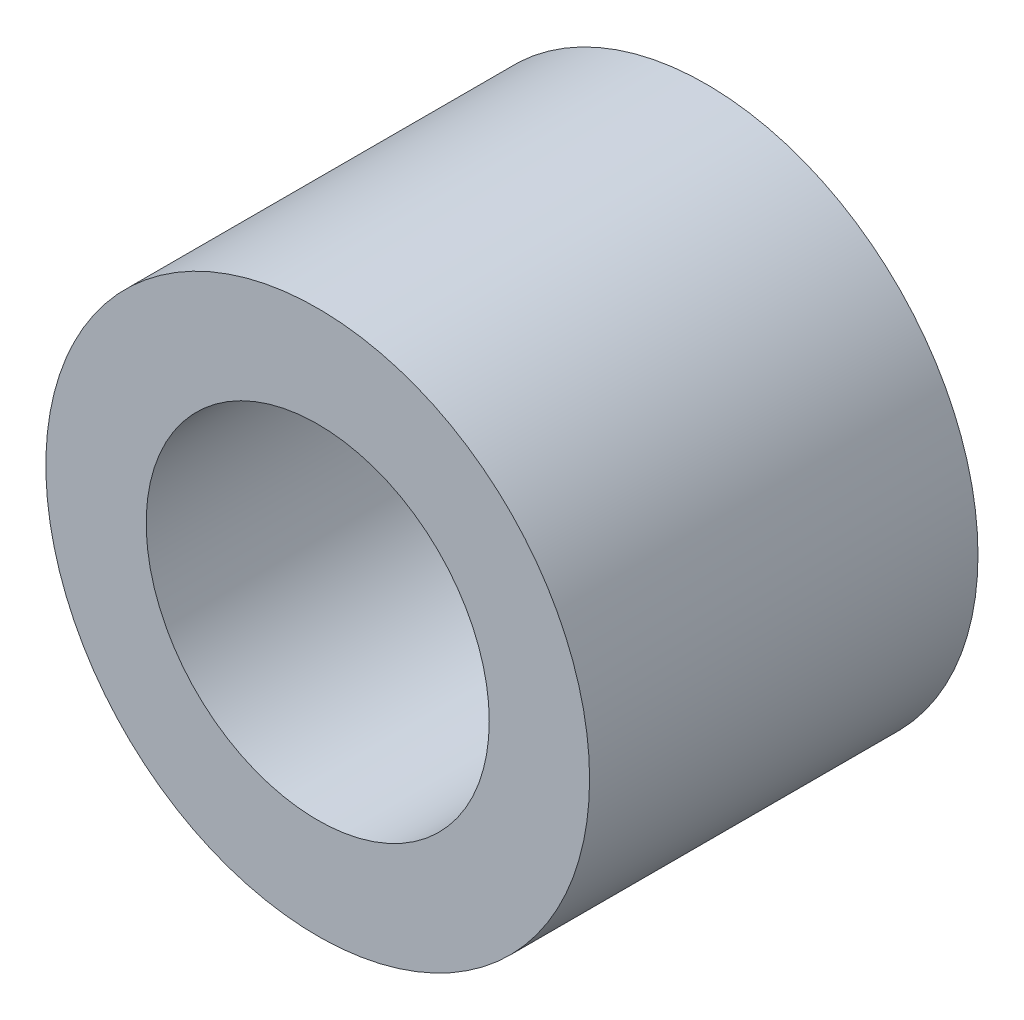
ISO-10303-21;
HEADER;
FILE_DESCRIPTION(('STEP AP214'),'2;1');
FILE_NAME('part.step','',(''),(''),'','','');
FILE_SCHEMA(('AUTOMOTIVE_DESIGN { 1 0 10303 214 1 1 1 1 }'));
ENDSEC;
DATA;
#1=APPLICATION_CONTEXT('core data for automotive mechanical design processes');
#2=APPLICATION_PROTOCOL_DEFINITION('international standard','automotive_design',2000,#1);
#3=PRODUCT_CONTEXT('',#1,'mechanical');
#4=PRODUCT('Part','Part','',(#3));
#5=PRODUCT_RELATED_PRODUCT_CATEGORY('part','',(#4));
#6=PRODUCT_DEFINITION_FORMATION('','',#4);
#7=PRODUCT_DEFINITION_CONTEXT('part definition',#1,'design');
#8=PRODUCT_DEFINITION('design','',#6,#7);
#9=PRODUCT_DEFINITION_SHAPE('','',#8);
#10=(LENGTH_UNIT() NAMED_UNIT(*) SI_UNIT(.MILLI.,.METRE.));
#11=(NAMED_UNIT(*) PLANE_ANGLE_UNIT() SI_UNIT($,.RADIAN.));
#12=(NAMED_UNIT(*) SI_UNIT($,.STERADIAN.) SOLID_ANGLE_UNIT());
#13=UNCERTAINTY_MEASURE_WITH_UNIT(LENGTH_MEASURE(1.E-05),#10,'distance_accuracy_value','');
#14=(GEOMETRIC_REPRESENTATION_CONTEXT(3) GLOBAL_UNCERTAINTY_ASSIGNED_CONTEXT((#13)) GLOBAL_UNIT_ASSIGNED_CONTEXT((#10,
#11,#12)) REPRESENTATION_CONTEXT('',''));
#15=CARTESIAN_POINT('',(0.,0.,0.));
#16=DIRECTION('',(0.,0.,1.));
#17=DIRECTION('',(1.,0.,0.));
#18=AXIS2_PLACEMENT_3D('',#15,#16,#17);
#19=CARTESIAN_POINT('',(0.,0.,0.));
#20=DIRECTION('',(0.,0.,-1.));
#21=DIRECTION('',(-1.,0.,0.));
#22=AXIS2_PLACEMENT_3D('',#19,#20,#21);
#23=PLANE('',#22);
#24=CARTESIAN_POINT('',(0.,0.,0.));
#25=DIRECTION('',(0.,0.,1.));
#26=DIRECTION('',(1.,0.,0.));
#27=AXIS2_PLACEMENT_3D('',#24,#25,#26);
#28=CIRCLE('',#27,1.325);
#29=CARTESIAN_POINT('',(1.325,0.,0.));
#30=VERTEX_POINT('',#29);
#31=EDGE_CURVE('E38',#30,#30,#28,.T.);
#32=ORIENTED_EDGE('',*,*,#31,.F.);
#33=EDGE_LOOP('',(#32));
#34=FACE_BOUND('',#33,.T.);
#35=CARTESIAN_POINT('',(0.,0.,0.));
#36=DIRECTION('',(0.,0.,1.));
#37=DIRECTION('',(1.,0.,0.));
#38=AXIS2_PLACEMENT_3D('',#35,#36,#37);
#39=CIRCLE('',#38,2.1);
#40=CARTESIAN_POINT('',(2.1,0.,0.));
#41=VERTEX_POINT('',#40);
#42=EDGE_CURVE('E46',#41,#41,#39,.T.);
#43=ORIENTED_EDGE('',*,*,#42,.T.);
#44=EDGE_LOOP('',(#43));
#45=FACE_BOUND('',#44,.T.);
#46=ADVANCED_FACE('F32',(#34,#45),#23,.F.);
#47=CARTESIAN_POINT('',(0.,0.,-3.));
#48=DIRECTION('',(0.,0.,1.));
#49=DIRECTION('',(1.,0.,0.));
#50=AXIS2_PLACEMENT_3D('',#47,#48,#49);
#51=PLANE('',#50);
#52=CARTESIAN_POINT('',(0.,0.,-3.));
#53=DIRECTION('',(0.,0.,1.));
#54=DIRECTION('',(1.,0.,0.));
#55=AXIS2_PLACEMENT_3D('',#52,#53,#54);
#56=CIRCLE('',#55,1.325);
#57=CARTESIAN_POINT('',(1.325,0.,-3.));
#58=VERTEX_POINT('',#57);
#59=EDGE_CURVE('E10',#58,#58,#56,.T.);
#60=ORIENTED_EDGE('',*,*,#59,.T.);
#61=EDGE_LOOP('',(#60));
#62=FACE_BOUND('',#61,.T.);
#63=CARTESIAN_POINT('',(0.,0.,-3.));
#64=DIRECTION('',(0.,0.,1.));
#65=DIRECTION('',(1.,0.,0.));
#66=AXIS2_PLACEMENT_3D('',#63,#64,#65);
#67=CIRCLE('',#66,2.1);
#68=CARTESIAN_POINT('',(2.1,0.,-3.));
#69=VERTEX_POINT('',#68);
#70=EDGE_CURVE('E42',#69,#69,#67,.F.);
#71=ORIENTED_EDGE('',*,*,#70,.T.);
#72=EDGE_LOOP('',(#71));
#73=FACE_BOUND('',#72,.T.);
#74=ADVANCED_FACE('F61',(#62,#73),#51,.F.);
#75=CARTESIAN_POINT('',(0.,0.,0.));
#76=DIRECTION('',(0.,0.,1.));
#77=DIRECTION('',(1.,0.,0.));
#78=AXIS2_PLACEMENT_3D('',#75,#76,#77);
#79=CYLINDRICAL_SURFACE('',#78,1.325);
#80=ORIENTED_EDGE('',*,*,#59,.F.);
#81=EDGE_LOOP('',(#80));
#82=FACE_BOUND('',#81,.T.);
#83=ORIENTED_EDGE('',*,*,#31,.T.);
#84=EDGE_LOOP('',(#83));
#85=FACE_BOUND('',#84,.T.);
#86=ADVANCED_FACE('F55',(#82,#85),#79,.F.);
#87=CARTESIAN_POINT('',(0.,0.,-8.939696961967));
#88=DIRECTION('',(0.,0.,1.));
#89=DIRECTION('',(1.,0.,0.));
#90=AXIS2_PLACEMENT_3D('',#87,#88,#89);
#91=CYLINDRICAL_SURFACE('',#90,2.1);
#92=ORIENTED_EDGE('',*,*,#70,.F.);
#93=EDGE_LOOP('',(#92));
#94=FACE_BOUND('',#93,.T.);
#95=ORIENTED_EDGE('',*,*,#42,.F.);
#96=EDGE_LOOP('',(#95));
#97=FACE_BOUND('',#96,.T.);
#98=ADVANCED_FACE('F53',(#94,#97),#91,.T.);
#99=CLOSED_SHELL('',(#46,#74,#86,#98));
#100=MANIFOLD_SOLID_BREP('B2',#99);
#101=ADVANCED_BREP_SHAPE_REPRESENTATION('',(#18,#100),#14);
#102=SHAPE_DEFINITION_REPRESENTATION(#9,#101);
ENDSEC;
END-ISO-10303-21;
